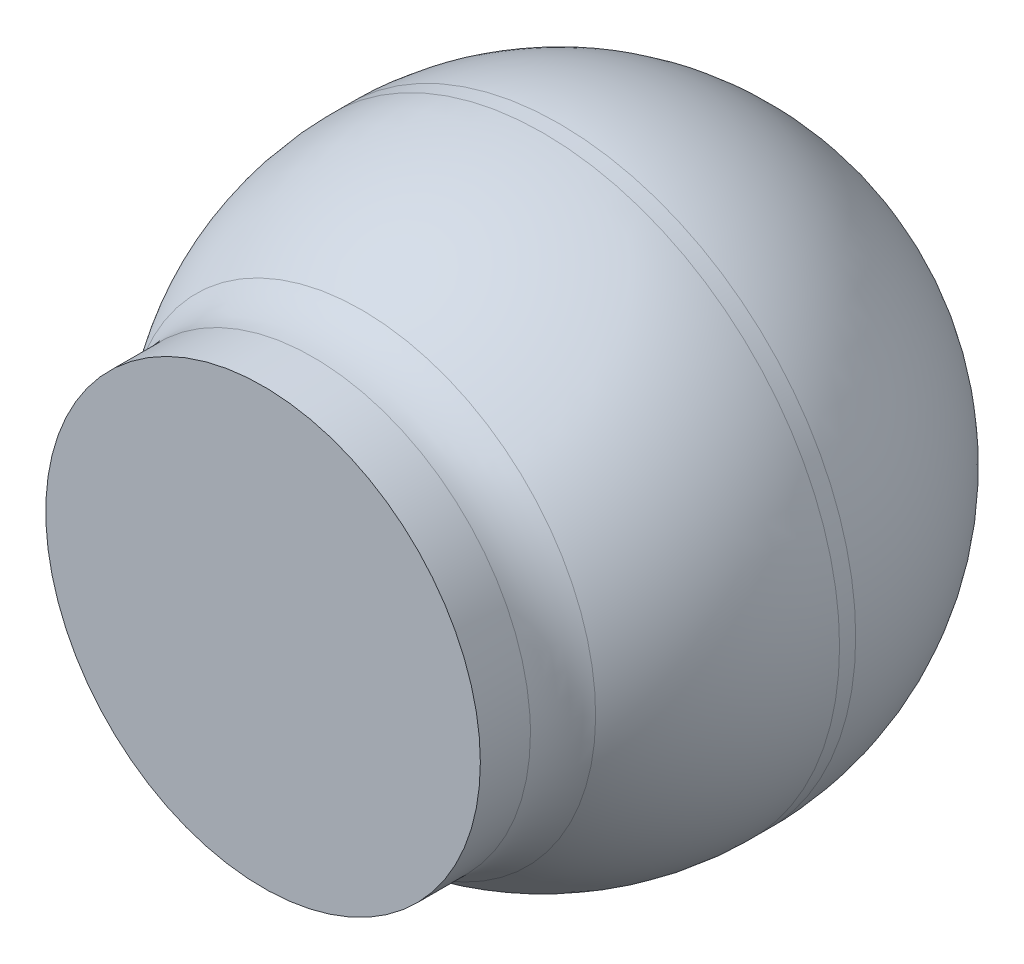
ISO-10303-21;
HEADER;
FILE_DESCRIPTION(('STEP AP214'),'2;1');
FILE_NAME('part.step','',(''),(''),'','','');
FILE_SCHEMA(('AUTOMOTIVE_DESIGN { 1 0 10303 214 1 1 1 1 }'));
ENDSEC;
DATA;
#1=APPLICATION_CONTEXT('core data for automotive mechanical design processes');
#2=APPLICATION_PROTOCOL_DEFINITION('international standard','automotive_design',2000,#1);
#3=PRODUCT_CONTEXT('',#1,'mechanical');
#4=PRODUCT('Part','Part','',(#3));
#5=PRODUCT_RELATED_PRODUCT_CATEGORY('part','',(#4));
#6=PRODUCT_DEFINITION_FORMATION('','',#4);
#7=PRODUCT_DEFINITION_CONTEXT('part definition',#1,'design');
#8=PRODUCT_DEFINITION('design','',#6,#7);
#9=PRODUCT_DEFINITION_SHAPE('','',#8);
#10=(LENGTH_UNIT() NAMED_UNIT(*) SI_UNIT(.MILLI.,.METRE.));
#11=(NAMED_UNIT(*) PLANE_ANGLE_UNIT() SI_UNIT($,.RADIAN.));
#12=(NAMED_UNIT(*) SI_UNIT($,.STERADIAN.) SOLID_ANGLE_UNIT());
#13=UNCERTAINTY_MEASURE_WITH_UNIT(LENGTH_MEASURE(1.E-05),#10,'distance_accuracy_value','');
#14=(GEOMETRIC_REPRESENTATION_CONTEXT(3) GLOBAL_UNCERTAINTY_ASSIGNED_CONTEXT((#13)) GLOBAL_UNIT_ASSIGNED_CONTEXT((#10,
#11,#12)) REPRESENTATION_CONTEXT('',''));
#15=CARTESIAN_POINT('',(0.,0.,0.));
#16=DIRECTION('',(0.,0.,1.));
#17=DIRECTION('',(1.,0.,0.));
#18=AXIS2_PLACEMENT_3D('',#15,#16,#17);
#19=CARTESIAN_POINT('',(-4.372919922269,-1.511349291452,10.006534503384));
#20=DIRECTION('',(0.,0.,-1.));
#21=DIRECTION('',(-1.,0.,0.));
#22=AXIS2_PLACEMENT_3D('',#19,#20,#21);
#23=PLANE('',#22);
#24=CARTESIAN_POINT('',(-4.372919922269,-1.511349291452,10.006534503384));
#25=DIRECTION('',(0.,0.,1.));
#26=DIRECTION('',(1.,0.,0.));
#27=AXIS2_PLACEMENT_3D('',#24,#25,#26);
#28=CIRCLE('',#27,0.275);
#29=CARTESIAN_POINT('',(-4.097919922269,-1.511349291452,10.006534503384));
#30=VERTEX_POINT('',#29);
#31=EDGE_CURVE('E20',#30,#30,#28,.F.);
#32=ORIENTED_EDGE('',*,*,#31,.F.);
#33=EDGE_LOOP('',(#32));
#34=FACE_BOUND('',#33,.T.);
#35=ADVANCED_FACE('F17',(#34),#23,.F.);
#36=CARTESIAN_POINT('',(-4.372919922269,-1.511349291452,9.906534503384));
#37=DIRECTION('',(0.,0.,1.));
#38=DIRECTION('',(1.,0.,0.));
#39=AXIS2_PLACEMENT_3D('',#36,#37,#38);
#40=CYLINDRICAL_SURFACE('',#39,0.275);
#41=CARTESIAN_POINT('',(-4.372919922269,-1.511349291452,9.943180457728));
#42=DIRECTION('',(0.,0.,-1.));
#43=DIRECTION('',(0.996700902337582,0.0811622527992462,0.));
#44=AXIS2_PLACEMENT_3D('',#41,#42,#43);
#45=CIRCLE('',#44,0.275);
#46=CARTESIAN_POINT('',(-4.09882717412617,-1.48902967193221,9.943180457728));
#47=VERTEX_POINT('',#46);
#48=EDGE_CURVE('E65',#47,#47,#45,.F.);
#49=ORIENTED_EDGE('',*,*,#48,.T.);
#50=EDGE_LOOP('',(#49));
#51=FACE_BOUND('',#50,.T.);
#52=ORIENTED_EDGE('',*,*,#31,.T.);
#53=EDGE_LOOP('',(#52));
#54=FACE_BOUND('',#53,.T.);
#55=ADVANCED_FACE('F62',(#51,#54),#40,.T.);
#56=CARTESIAN_POINT('',(-4.372919922269,-1.511349291452,9.943180457728));
#57=DIRECTION('',(0.,0.,-1.));
#58=DIRECTION('',(0.996700902337583,0.081162252799246,0.));
#59=AXIS2_PLACEMENT_3D('',#56,#57,#58);
#60=TOROIDAL_SURFACE('',#59,0.375,0.1);
#61=ORIENTED_EDGE('',*,*,#48,.F.);
#62=EDGE_LOOP('',(#61));
#63=FACE_BOUND('',#62,.T.);
#64=CARTESIAN_POINT('',(-4.372919922269,-1.511349291452,9.881744931236));
#65=DIRECTION('',(0.,0.,-1.));
#66=DIRECTION('',(-0.996700902337598,-0.0811622527990615,0.));
#67=AXIS2_PLACEMENT_3D('',#64,#65,#66);
#68=CIRCLE('',#67,0.296097046412665);
#69=CARTESIAN_POINT('',(-4.668040115608,-1.535381194786,9.881744931236));
#70=VERTEX_POINT('',#69);
#71=EDGE_CURVE('E39',#70,#70,#68,.T.);
#72=ORIENTED_EDGE('',*,*,#71,.F.);
#73=EDGE_LOOP('',(#72));
#74=FACE_BOUND('',#73,.T.);
#75=ADVANCED_FACE('F57',(#63,#74),#60,.F.);
#76=CARTESIAN_POINT('',(-4.746682760645,-1.541785136252,9.651976062157));
#77=CARTESIAN_POINT('',(-4.746682760645,-1.541785136252,9.701461392103));
#78=CARTESIAN_POINT('',(-4.738526217348,-1.541120941579,9.750947004335));
#79=CARTESIAN_POINT('',(-4.722207085349,-1.539792059952,9.798626332798));
#80=CARTESIAN_POINT('',(-4.698341390838,-1.537848654938,9.842699544317));
#81=CARTESIAN_POINT('',(-4.668040115608,-1.535381194786,9.881744931236));
#82=(BOUNDED_CURVE() B_SPLINE_CURVE(5,(#76,#77,#78,#79,#80,#81),.UNSPECIFIED.,.F.,
.F.) B_SPLINE_CURVE_WITH_KNOTS((6,6),(0.,0.661568582165),
.UNSPECIFIED.) CURVE() GEOMETRIC_REPRESENTATION_ITEM() RATIONAL_B_SPLINE_CURVE((1.,1.,1.,1.,1.,1.)) REPRESENTATION_ITEM(''));
#83=CARTESIAN_POINT('',(-4.372919922269,-1.511349291452,9.651976062157));
#84=DIRECTION('',(0.,0.,-1.));
#85=AXIS1_PLACEMENT('',#83,#84);
#86=SURFACE_OF_REVOLUTION('',#82,#85);
#87=CARTESIAN_POINT('',(-4.372919922269,-1.511349291452,9.651976062157));
#88=DIRECTION('',(0.,0.,1.));
#89=DIRECTION('',(1.,0.,0.));
#90=AXIS2_PLACEMENT_3D('',#87,#88,#89);
#91=CIRCLE('',#90,0.375);
#92=CARTESIAN_POINT('',(-3.997919922269,-1.511349291452,9.651976062157));
#93=VERTEX_POINT('',#92);
#94=EDGE_CURVE('E36',#93,#93,#91,.F.);
#95=ORIENTED_EDGE('',*,*,#94,.F.);
#96=EDGE_LOOP('',(#95));
#97=FACE_BOUND('',#96,.T.);
#98=ORIENTED_EDGE('',*,*,#71,.T.);
#99=EDGE_LOOP('',(#98));
#100=FACE_BOUND('',#99,.T.);
#101=ADVANCED_FACE('F53',(#97,#100),#86,.F.);
#102=CARTESIAN_POINT('',(-4.372919922269,-1.511349291452,9.256534503384));
#103=DIRECTION('',(0.,0.,1.));
#104=DIRECTION('',(1.,0.,0.));
#105=AXIS2_PLACEMENT_3D('',#102,#103,#104);
#106=CYLINDRICAL_SURFACE('',#105,0.375);
#107=CARTESIAN_POINT('',(-4.372919922269,-1.511349291452,9.631534503384));
#108=DIRECTION('',(0.,0.,-1.));
#109=DIRECTION('',(0.0811622527992356,-0.996700902337583,0.));
#110=AXIS2_PLACEMENT_3D('',#107,#108,#109);
#111=CIRCLE('',#110,0.375);
#112=CARTESIAN_POINT('',(-4.34248407746929,-1.88511212982859,9.631534503384));
#113=VERTEX_POINT('',#112);
#114=CARTESIAN_POINT('',(-4.40335576706871,-1.13758645307541,9.631534503384));
#115=VERTEX_POINT('',#114);
#116=EDGE_CURVE('E11',#113,#115,#111,.T.);
#117=ORIENTED_EDGE('',*,*,#116,.F.);
#118=CARTESIAN_POINT('',(-4.372919922269,-1.511349291452,9.631534503384));
#119=DIRECTION('',(3.33436315446763E-12,2.72100352061447E-13,1.));
#120=DIRECTION('',(0.0811622527992365,-0.996700902337583,0.));
#121=AXIS2_PLACEMENT_3D('',#118,#119,#120);
#122=CIRCLE('',#121,0.375);
#123=EDGE_CURVE('E25',#115,#113,#122,.F.);
#124=ORIENTED_EDGE('',*,*,#123,.F.);
#125=EDGE_LOOP('',(#117,#124));
#126=FACE_BOUND('',#125,.T.);
#127=ORIENTED_EDGE('',*,*,#94,.T.);
#128=EDGE_LOOP('',(#127));
#129=FACE_BOUND('',#128,.T.);
#130=ADVANCED_FACE('F34',(#126,#129),#106,.T.);
#131=CARTESIAN_POINT('',(-4.372919922269,-1.511349291452,9.631534503384));
#132=DIRECTION('',(0.0811622527992361,-0.996700902337583,0.));
#133=DIRECTION('',(-0.996700902337583,-0.0811622527992361,0.));
#134=AXIS2_PLACEMENT_3D('',#131,#132,#133);
#135=SPHERICAL_SURFACE('',#134,0.375);
#136=ORIENTED_EDGE('',*,*,#123,.T.);
#137=ORIENTED_EDGE('',*,*,#116,.T.);
#138=EDGE_LOOP('',(#136,#137));
#139=FACE_BOUND('',#138,.T.);
#140=ADVANCED_FACE('F32',(#139),#135,.T.);
#141=CLOSED_SHELL('',(#35,#55,#75,#101,#130,#140));
#142=MANIFOLD_SOLID_BREP('B1',#141);
#143=ADVANCED_BREP_SHAPE_REPRESENTATION('',(#18,#142),#14);
#144=SHAPE_DEFINITION_REPRESENTATION(#9,#143);
ENDSEC;
END-ISO-10303-21;
